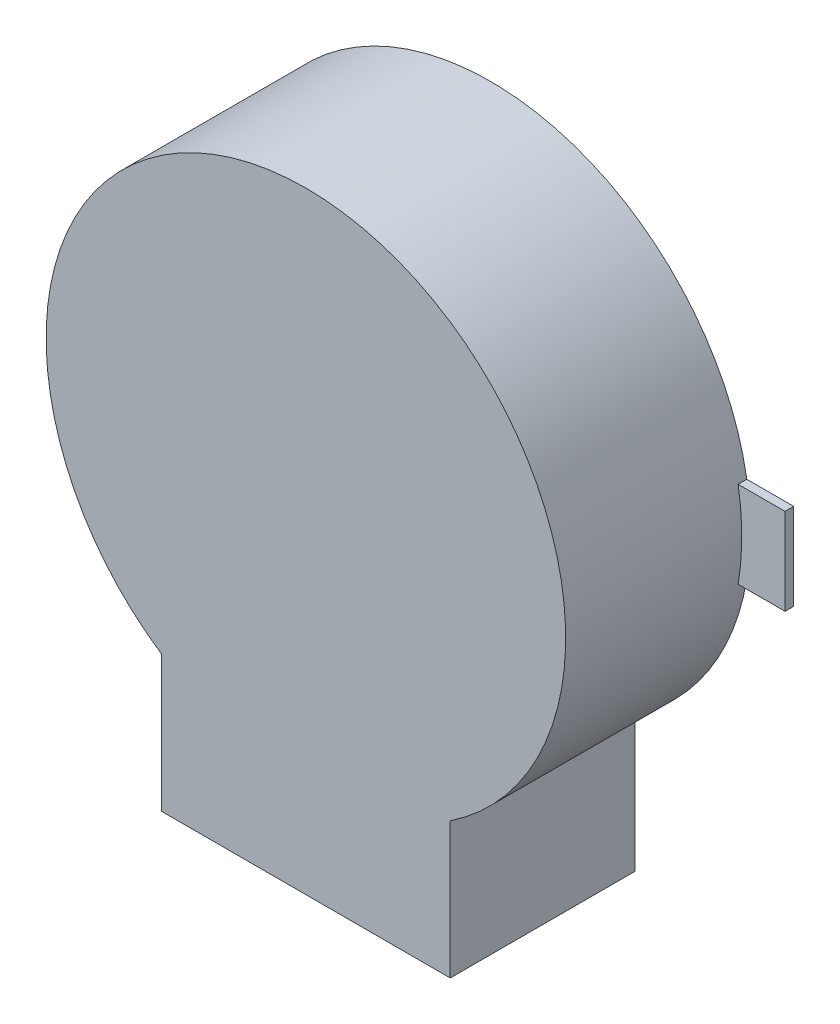
ISO-10303-21;
HEADER;
FILE_DESCRIPTION(('STEP AP214'),'2;1');
FILE_NAME('part.step','',(''),(''),'','','');
FILE_SCHEMA(('AUTOMOTIVE_DESIGN { 1 0 10303 214 1 1 1 1 }'));
ENDSEC;
DATA;
#1=APPLICATION_CONTEXT('core data for automotive mechanical design processes');
#2=APPLICATION_PROTOCOL_DEFINITION('international standard','automotive_design',2000,#1);
#3=PRODUCT_CONTEXT('',#1,'mechanical');
#4=PRODUCT('Part','Part','',(#3));
#5=PRODUCT_RELATED_PRODUCT_CATEGORY('part','',(#4));
#6=PRODUCT_DEFINITION_FORMATION('','',#4);
#7=PRODUCT_DEFINITION_CONTEXT('part definition',#1,'design');
#8=PRODUCT_DEFINITION('design','',#6,#7);
#9=PRODUCT_DEFINITION_SHAPE('','',#8);
#10=(LENGTH_UNIT() NAMED_UNIT(*) SI_UNIT(.MILLI.,.METRE.));
#11=(NAMED_UNIT(*) PLANE_ANGLE_UNIT() SI_UNIT($,.RADIAN.));
#12=(NAMED_UNIT(*) SI_UNIT($,.STERADIAN.) SOLID_ANGLE_UNIT());
#13=UNCERTAINTY_MEASURE_WITH_UNIT(LENGTH_MEASURE(1.E-05),#10,'distance_accuracy_value','');
#14=(GEOMETRIC_REPRESENTATION_CONTEXT(3) GLOBAL_UNCERTAINTY_ASSIGNED_CONTEXT((#13)) GLOBAL_UNIT_ASSIGNED_CONTEXT((#10,
#11,#12)) REPRESENTATION_CONTEXT('',''));
#15=CARTESIAN_POINT('',(0.,0.,0.));
#16=DIRECTION('',(0.,0.,1.));
#17=DIRECTION('',(1.,0.,0.));
#18=AXIS2_PLACEMENT_3D('',#15,#16,#17);
#19=CARTESIAN_POINT('',(-5.25,0.,0.15));
#20=DIRECTION('',(-1.,0.,0.));
#21=DIRECTION('',(0.,0.,1.));
#22=AXIS2_PLACEMENT_3D('',#19,#20,#21);
#23=PLANE('',#22);
#24=DIRECTION('',(0.,1.,0.));
#25=VECTOR('',#24,1.);
#26=CARTESIAN_POINT('',(-5.25,0.,0.));
#27=LINE('',#26,#25);
#28=CARTESIAN_POINT('',(-5.25,-0.75,0.));
#29=VERTEX_POINT('',#28);
#30=CARTESIAN_POINT('',(-5.25,0.75,0.));
#31=VERTEX_POINT('',#30);
#32=EDGE_CURVE('E11',#29,#31,#27,.T.);
#33=ORIENTED_EDGE('',*,*,#32,.F.);
#34=DIRECTION('',(0.,0.,-1.));
#35=VECTOR('',#34,1.);
#36=CARTESIAN_POINT('',(-5.25,-0.75,0.15));
#37=LINE('',#36,#35);
#38=CARTESIAN_POINT('',(-5.25,-0.75,0.15));
#39=VERTEX_POINT('',#38);
#40=EDGE_CURVE('E201',#39,#29,#37,.T.);
#41=ORIENTED_EDGE('',*,*,#40,.F.);
#42=DIRECTION('',(0.,1.,0.));
#43=VECTOR('',#42,1.);
#44=CARTESIAN_POINT('',(-5.25,0.,0.15));
#45=LINE('',#44,#43);
#46=CARTESIAN_POINT('',(-5.25,0.75,0.15));
#47=VERTEX_POINT('',#46);
#48=EDGE_CURVE('E190',#39,#47,#45,.T.);
#49=ORIENTED_EDGE('',*,*,#48,.T.);
#50=DIRECTION('',(0.,0.,-1.));
#51=VECTOR('',#50,1.);
#52=CARTESIAN_POINT('',(-5.25,0.75,0.15));
#53=LINE('',#52,#51);
#54=EDGE_CURVE('E174',#47,#31,#53,.T.);
#55=ORIENTED_EDGE('',*,*,#54,.T.);
#56=EDGE_LOOP('',(#33,#41,#49,#55));
#57=FACE_BOUND('',#56,.T.);
#58=ADVANCED_FACE('F17',(#57),#23,.T.);
#59=CARTESIAN_POINT('',(0.,-0.8,3.2));
#60=DIRECTION('',(0.,0.,1.));
#61=DIRECTION('',(1.,0.,0.));
#62=AXIS2_PLACEMENT_3D('',#59,#60,#61);
#63=PLANE('',#62);
#64=CARTESIAN_POINT('',(0.,0.,3.2));
#65=DIRECTION('',(0.,0.,1.));
#66=DIRECTION('',(1.,0.,0.));
#67=AXIS2_PLACEMENT_3D('',#64,#65,#66);
#68=CIRCLE('',#67,4.5);
#69=CARTESIAN_POINT('',(2.5,-3.74165738677395,3.2));
#70=VERTEX_POINT('',#69);
#71=CARTESIAN_POINT('',(-2.5,-3.74165738677394,3.2));
#72=VERTEX_POINT('',#71);
#73=EDGE_CURVE('E212',#70,#72,#68,.T.);
#74=ORIENTED_EDGE('',*,*,#73,.T.);
#75=DIRECTION('',(0.,-1.,0.));
#76=VECTOR('',#75,1.);
#77=CARTESIAN_POINT('',(-2.5,-4.92082869338697,3.2));
#78=LINE('',#77,#76);
#79=CARTESIAN_POINT('',(-2.5,-6.1,3.2));
#80=VERTEX_POINT('',#79);
#81=EDGE_CURVE('E184',#72,#80,#78,.T.);
#82=ORIENTED_EDGE('',*,*,#81,.T.);
#83=DIRECTION('',(1.,0.,0.));
#84=VECTOR('',#83,1.);
#85=CARTESIAN_POINT('',(0.,-6.1,3.2));
#86=LINE('',#85,#84);
#87=CARTESIAN_POINT('',(2.5,-6.1,3.2));
#88=VERTEX_POINT('',#87);
#89=EDGE_CURVE('E202',#80,#88,#86,.T.);
#90=ORIENTED_EDGE('',*,*,#89,.T.);
#91=DIRECTION('',(0.,-1.,0.));
#92=VECTOR('',#91,1.);
#93=CARTESIAN_POINT('',(2.5,-4.92082869338697,3.2));
#94=LINE('',#93,#92);
#95=EDGE_CURVE('E28',#70,#88,#94,.T.);
#96=ORIENTED_EDGE('',*,*,#95,.F.);
#97=EDGE_LOOP('',(#74,#82,#90,#96));
#98=FACE_BOUND('',#97,.T.);
#99=ADVANCED_FACE('F305',(#98),#63,.T.);
#100=CARTESIAN_POINT('',(0.,-0.8,0.));
#101=DIRECTION('',(0.,0.,1.));
#102=DIRECTION('',(1.,0.,0.));
#103=AXIS2_PLACEMENT_3D('',#100,#101,#102);
#104=PLANE('',#103);
#105=CARTESIAN_POINT('',(0.,0.,0.));
#106=DIRECTION('',(0.,0.,1.));
#107=DIRECTION('',(1.,0.,0.));
#108=AXIS2_PLACEMENT_3D('',#105,#106,#107);
#109=CIRCLE('',#108,4.5);
#110=CARTESIAN_POINT('',(-4.43705983732471,-0.75,0.));
#111=VERTEX_POINT('',#110);
#112=CARTESIAN_POINT('',(-2.5,-3.74165738677394,0.));
#113=VERTEX_POINT('',#112);
#114=EDGE_CURVE('E175',#111,#113,#109,.T.);
#115=ORIENTED_EDGE('',*,*,#114,.F.);
#116=DIRECTION('',(1.,0.,0.));
#117=VECTOR('',#116,1.);
#118=CARTESIAN_POINT('',(0.,-0.75,0.));
#119=LINE('',#118,#117);
#120=EDGE_CURVE('E198',#29,#111,#119,.T.);
#121=ORIENTED_EDGE('',*,*,#120,.F.);
#122=ORIENTED_EDGE('',*,*,#32,.T.);
#123=DIRECTION('',(1.,0.,0.));
#124=VECTOR('',#123,1.);
#125=CARTESIAN_POINT('',(0.,0.75,0.));
#126=LINE('',#125,#124);
#127=CARTESIAN_POINT('',(-4.43705983732471,0.75,0.));
#128=VERTEX_POINT('',#127);
#129=EDGE_CURVE('E21',#31,#128,#126,.T.);
#130=ORIENTED_EDGE('',*,*,#129,.T.);
#131=CARTESIAN_POINT('',(0.,0.,0.));
#132=DIRECTION('',(0.,0.,1.));
#133=DIRECTION('',(1.,0.,0.));
#134=AXIS2_PLACEMENT_3D('',#131,#132,#133);
#135=CIRCLE('',#134,4.5);
#136=CARTESIAN_POINT('',(4.43705983732471,0.75,0.));
#137=VERTEX_POINT('',#136);
#138=EDGE_CURVE('E144',#137,#128,#135,.T.);
#139=ORIENTED_EDGE('',*,*,#138,.F.);
#140=DIRECTION('',(1.,0.,0.));
#141=VECTOR('',#140,1.);
#142=CARTESIAN_POINT('',(0.,0.75,0.));
#143=LINE('',#142,#141);
#144=CARTESIAN_POINT('',(5.25,0.75,0.));
#145=VERTEX_POINT('',#144);
#146=EDGE_CURVE('E139',#137,#145,#143,.T.);
#147=ORIENTED_EDGE('',*,*,#146,.T.);
#148=DIRECTION('',(0.,1.,0.));
#149=VECTOR('',#148,1.);
#150=CARTESIAN_POINT('',(5.25,0.,0.));
#151=LINE('',#150,#149);
#152=CARTESIAN_POINT('',(5.25,-0.75,0.));
#153=VERTEX_POINT('',#152);
#154=EDGE_CURVE('E131',#153,#145,#151,.T.);
#155=ORIENTED_EDGE('',*,*,#154,.F.);
#156=DIRECTION('',(1.,0.,0.));
#157=VECTOR('',#156,1.);
#158=CARTESIAN_POINT('',(0.,-0.75,0.));
#159=LINE('',#158,#157);
#160=CARTESIAN_POINT('',(4.43705983732471,-0.75,0.));
#161=VERTEX_POINT('',#160);
#162=EDGE_CURVE('E136',#161,#153,#159,.T.);
#163=ORIENTED_EDGE('',*,*,#162,.F.);
#164=CARTESIAN_POINT('',(0.,0.,0.));
#165=DIRECTION('',(0.,0.,1.));
#166=DIRECTION('',(1.,0.,0.));
#167=AXIS2_PLACEMENT_3D('',#164,#165,#166);
#168=CIRCLE('',#167,4.5);
#169=CARTESIAN_POINT('',(2.5,-3.74165738677395,0.));
#170=VERTEX_POINT('',#169);
#171=EDGE_CURVE('E272',#170,#161,#168,.T.);
#172=ORIENTED_EDGE('',*,*,#171,.F.);
#173=DIRECTION('',(0.,-1.,0.));
#174=VECTOR('',#173,1.);
#175=CARTESIAN_POINT('',(2.5,-4.92082869338697,0.));
#176=LINE('',#175,#174);
#177=CARTESIAN_POINT('',(2.5,-6.1,0.));
#178=VERTEX_POINT('',#177);
#179=EDGE_CURVE('E205',#170,#178,#176,.T.);
#180=ORIENTED_EDGE('',*,*,#179,.T.);
#181=DIRECTION('',(1.,0.,0.));
#182=VECTOR('',#181,1.);
#183=CARTESIAN_POINT('',(0.,-6.1,0.));
#184=LINE('',#183,#182);
#185=CARTESIAN_POINT('',(-2.5,-6.1,0.));
#186=VERTEX_POINT('',#185);
#187=EDGE_CURVE('E281',#186,#178,#184,.T.);
#188=ORIENTED_EDGE('',*,*,#187,.F.);
#189=DIRECTION('',(0.,-1.,0.));
#190=VECTOR('',#189,1.);
#191=CARTESIAN_POINT('',(-2.5,-4.92082869338697,0.));
#192=LINE('',#191,#190);
#193=EDGE_CURVE('E185',#113,#186,#192,.T.);
#194=ORIENTED_EDGE('',*,*,#193,.F.);
#195=EDGE_LOOP('',(#115,#121,#122,#130,#139,#147,#155,#163,#172,#180,#188,#194));
#196=FACE_BOUND('',#195,.T.);
#197=ADVANCED_FACE('F133',(#196),#104,.F.);
#198=CARTESIAN_POINT('',(2.5,-4.92082869338697,3.2));
#199=DIRECTION('',(1.,0.,0.));
#200=DIRECTION('',(0.,1.,0.));
#201=AXIS2_PLACEMENT_3D('',#198,#199,#200);
#202=PLANE('',#201);
#203=ORIENTED_EDGE('',*,*,#179,.F.);
#204=DIRECTION('',(0.,0.,-1.));
#205=VECTOR('',#204,1.);
#206=CARTESIAN_POINT('',(2.5,-3.74165738677395,3.2));
#207=LINE('',#206,#205);
#208=EDGE_CURVE('E216',#70,#170,#207,.T.);
#209=ORIENTED_EDGE('',*,*,#208,.F.);
#210=ORIENTED_EDGE('',*,*,#95,.T.);
#211=DIRECTION('',(0.,0.,-1.));
#212=VECTOR('',#211,1.);
#213=CARTESIAN_POINT('',(2.5,-6.1,3.2));
#214=LINE('',#213,#212);
#215=EDGE_CURVE('E206',#88,#178,#214,.T.);
#216=ORIENTED_EDGE('',*,*,#215,.T.);
#217=EDGE_LOOP('',(#203,#209,#210,#216));
#218=FACE_BOUND('',#217,.T.);
#219=ADVANCED_FACE('F291',(#218),#202,.T.);
#220=CARTESIAN_POINT('',(0.,-6.1,3.2));
#221=DIRECTION('',(0.,1.,0.));
#222=DIRECTION('',(1.,0.,0.));
#223=AXIS2_PLACEMENT_3D('',#220,#221,#222);
#224=PLANE('',#223);
#225=ORIENTED_EDGE('',*,*,#187,.T.);
#226=ORIENTED_EDGE('',*,*,#215,.F.);
#227=ORIENTED_EDGE('',*,*,#89,.F.);
#228=DIRECTION('',(0.,0.,-1.));
#229=VECTOR('',#228,1.);
#230=CARTESIAN_POINT('',(-2.5,-6.1,3.2));
#231=LINE('',#230,#229);
#232=EDGE_CURVE('E180',#80,#186,#231,.T.);
#233=ORIENTED_EDGE('',*,*,#232,.T.);
#234=EDGE_LOOP('',(#225,#226,#227,#233));
#235=FACE_BOUND('',#234,.T.);
#236=ADVANCED_FACE('F293',(#235),#224,.F.);
#237=CARTESIAN_POINT('',(-2.5,-4.92082869338697,3.2));
#238=DIRECTION('',(1.,0.,0.));
#239=DIRECTION('',(0.,1.,0.));
#240=AXIS2_PLACEMENT_3D('',#237,#238,#239);
#241=PLANE('',#240);
#242=ORIENTED_EDGE('',*,*,#193,.T.);
#243=ORIENTED_EDGE('',*,*,#232,.F.);
#244=ORIENTED_EDGE('',*,*,#81,.F.);
#245=DIRECTION('',(0.,0.,-1.));
#246=VECTOR('',#245,1.);
#247=CARTESIAN_POINT('',(-2.5,-3.74165738677394,3.2));
#248=LINE('',#247,#246);
#249=EDGE_CURVE('E179',#72,#113,#248,.T.);
#250=ORIENTED_EDGE('',*,*,#249,.T.);
#251=EDGE_LOOP('',(#242,#243,#244,#250));
#252=FACE_BOUND('',#251,.T.);
#253=ADVANCED_FACE('F301',(#252),#241,.F.);
#254=CARTESIAN_POINT('',(0.,0.,3.2));
#255=DIRECTION('',(0.,0.,1.));
#256=DIRECTION('',(-1.,0.,0.));
#257=AXIS2_PLACEMENT_3D('',#254,#255,#256);
#258=CYLINDRICAL_SURFACE('',#257,4.5);
#259=DIRECTION('',(0.,0.,-1.));
#260=VECTOR('',#259,1.);
#261=CARTESIAN_POINT('',(4.43705983732471,-0.75,3.2));
#262=LINE('',#261,#260);
#263=CARTESIAN_POINT('',(4.43705983732471,-0.75,0.15));
#264=VERTEX_POINT('',#263);
#265=EDGE_CURVE('E159',#264,#161,#262,.T.);
#266=ORIENTED_EDGE('',*,*,#265,.F.);
#267=CARTESIAN_POINT('',(0.,0.,0.15));
#268=DIRECTION('',(0.,0.,-1.));
#269=DIRECTION('',(-1.,0.,0.));
#270=AXIS2_PLACEMENT_3D('',#267,#268,#269);
#271=CIRCLE('',#270,4.5);
#272=CARTESIAN_POINT('',(4.43705983732471,0.75,0.15));
#273=VERTEX_POINT('',#272);
#274=EDGE_CURVE('E228',#273,#264,#271,.T.);
#275=ORIENTED_EDGE('',*,*,#274,.F.);
#276=DIRECTION('',(0.,0.,-1.));
#277=VECTOR('',#276,1.);
#278=CARTESIAN_POINT('',(4.43705983732471,0.75,3.2));
#279=LINE('',#278,#277);
#280=EDGE_CURVE('E170',#273,#137,#279,.T.);
#281=ORIENTED_EDGE('',*,*,#280,.T.);
#282=ORIENTED_EDGE('',*,*,#138,.T.);
#283=DIRECTION('',(0.,0.,1.));
#284=VECTOR('',#283,1.);
#285=CARTESIAN_POINT('',(-4.43705983732471,0.75,3.2));
#286=LINE('',#285,#284);
#287=CARTESIAN_POINT('',(-4.43705983732471,0.75,0.15));
#288=VERTEX_POINT('',#287);
#289=EDGE_CURVE('E249',#128,#288,#286,.T.);
#290=ORIENTED_EDGE('',*,*,#289,.T.);
#291=CARTESIAN_POINT('',(0.,0.,0.15));
#292=DIRECTION('',(0.,0.,-1.));
#293=DIRECTION('',(-1.,0.,0.));
#294=AXIS2_PLACEMENT_3D('',#291,#292,#293);
#295=CIRCLE('',#294,4.5);
#296=CARTESIAN_POINT('',(-4.43705983732471,-0.75,0.15));
#297=VERTEX_POINT('',#296);
#298=EDGE_CURVE('E155',#297,#288,#295,.T.);
#299=ORIENTED_EDGE('',*,*,#298,.F.);
#300=DIRECTION('',(0.,0.,1.));
#301=VECTOR('',#300,1.);
#302=CARTESIAN_POINT('',(-4.43705983732471,-0.75,3.2));
#303=LINE('',#302,#301);
#304=EDGE_CURVE('E193',#111,#297,#303,.T.);
#305=ORIENTED_EDGE('',*,*,#304,.F.);
#306=ORIENTED_EDGE('',*,*,#114,.T.);
#307=ORIENTED_EDGE('',*,*,#249,.F.);
#308=ORIENTED_EDGE('',*,*,#73,.F.);
#309=ORIENTED_EDGE('',*,*,#208,.T.);
#310=ORIENTED_EDGE('',*,*,#171,.T.);
#311=EDGE_LOOP('',(#266,#275,#281,#282,#290,#299,#305,#306,#307,#308,#309,#310));
#312=FACE_BOUND('',#311,.T.);
#313=ADVANCED_FACE('F246',(#312),#258,.T.);
#314=CARTESIAN_POINT('',(5.25,0.,0.15));
#315=DIRECTION('',(-1.,0.,0.));
#316=DIRECTION('',(0.,0.,1.));
#317=AXIS2_PLACEMENT_3D('',#314,#315,#316);
#318=PLANE('',#317);
#319=ORIENTED_EDGE('',*,*,#154,.T.);
#320=DIRECTION('',(0.,0.,-1.));
#321=VECTOR('',#320,1.);
#322=CARTESIAN_POINT('',(5.25,0.75,0.15));
#323=LINE('',#322,#321);
#324=CARTESIAN_POINT('',(5.25,0.75,0.15));
#325=VERTEX_POINT('',#324);
#326=EDGE_CURVE('E173',#325,#145,#323,.T.);
#327=ORIENTED_EDGE('',*,*,#326,.F.);
#328=DIRECTION('',(0.,1.,0.));
#329=VECTOR('',#328,1.);
#330=CARTESIAN_POINT('',(5.25,0.,0.15));
#331=LINE('',#330,#329);
#332=CARTESIAN_POINT('',(5.25,-0.75,0.15));
#333=VERTEX_POINT('',#332);
#334=EDGE_CURVE('E150',#333,#325,#331,.T.);
#335=ORIENTED_EDGE('',*,*,#334,.F.);
#336=DIRECTION('',(0.,0.,-1.));
#337=VECTOR('',#336,1.);
#338=CARTESIAN_POINT('',(5.25,-0.75,0.15));
#339=LINE('',#338,#337);
#340=EDGE_CURVE('E147',#333,#153,#339,.T.);
#341=ORIENTED_EDGE('',*,*,#340,.T.);
#342=EDGE_LOOP('',(#319,#327,#335,#341));
#343=FACE_BOUND('',#342,.T.);
#344=ADVANCED_FACE('F148',(#343),#318,.F.);
#345=CARTESIAN_POINT('',(0.,0.75,0.15));
#346=DIRECTION('',(0.,1.,0.));
#347=DIRECTION('',(1.,0.,0.));
#348=AXIS2_PLACEMENT_3D('',#345,#346,#347);
#349=PLANE('',#348);
#350=ORIENTED_EDGE('',*,*,#280,.F.);
#351=DIRECTION('',(1.,0.,0.));
#352=VECTOR('',#351,1.);
#353=CARTESIAN_POINT('',(0.,0.75,0.15));
#354=LINE('',#353,#352);
#355=EDGE_CURVE('E220',#273,#325,#354,.T.);
#356=ORIENTED_EDGE('',*,*,#355,.T.);
#357=ORIENTED_EDGE('',*,*,#326,.T.);
#358=ORIENTED_EDGE('',*,*,#146,.F.);
#359=EDGE_LOOP('',(#350,#356,#357,#358));
#360=FACE_BOUND('',#359,.T.);
#361=ADVANCED_FACE('F325',(#360),#349,.T.);
#362=CARTESIAN_POINT('',(0.,0.75,0.15));
#363=DIRECTION('',(0.,1.,0.));
#364=DIRECTION('',(1.,0.,0.));
#365=AXIS2_PLACEMENT_3D('',#362,#363,#364);
#366=PLANE('',#365);
#367=ORIENTED_EDGE('',*,*,#289,.F.);
#368=ORIENTED_EDGE('',*,*,#129,.F.);
#369=ORIENTED_EDGE('',*,*,#54,.F.);
#370=DIRECTION('',(1.,0.,0.));
#371=VECTOR('',#370,1.);
#372=CARTESIAN_POINT('',(0.,0.75,0.15));
#373=LINE('',#372,#371);
#374=EDGE_CURVE('E186',#47,#288,#373,.T.);
#375=ORIENTED_EDGE('',*,*,#374,.T.);
#376=EDGE_LOOP('',(#367,#368,#369,#375));
#377=FACE_BOUND('',#376,.T.);
#378=ADVANCED_FACE('F255',(#377),#366,.T.);
#379=CARTESIAN_POINT('',(0.,-0.8,0.15));
#380=DIRECTION('',(0.,0.,-1.));
#381=DIRECTION('',(0.,-1.,0.));
#382=AXIS2_PLACEMENT_3D('',#379,#380,#381);
#383=PLANE('',#382);
#384=ORIENTED_EDGE('',*,*,#355,.F.);
#385=ORIENTED_EDGE('',*,*,#274,.T.);
#386=DIRECTION('',(1.,0.,0.));
#387=VECTOR('',#386,1.);
#388=CARTESIAN_POINT('',(0.,-0.75,0.15));
#389=LINE('',#388,#387);
#390=EDGE_CURVE('E166',#264,#333,#389,.T.);
#391=ORIENTED_EDGE('',*,*,#390,.T.);
#392=ORIENTED_EDGE('',*,*,#334,.T.);
#393=EDGE_LOOP('',(#384,#385,#391,#392));
#394=FACE_BOUND('',#393,.T.);
#395=ADVANCED_FACE('F319',(#394),#383,.F.);
#396=CARTESIAN_POINT('',(0.,-0.8,0.15));
#397=DIRECTION('',(0.,0.,-1.));
#398=DIRECTION('',(0.,-1.,0.));
#399=AXIS2_PLACEMENT_3D('',#396,#397,#398);
#400=PLANE('',#399);
#401=DIRECTION('',(1.,0.,0.));
#402=VECTOR('',#401,1.);
#403=CARTESIAN_POINT('',(0.,-0.75,0.15));
#404=LINE('',#403,#402);
#405=EDGE_CURVE('E197',#39,#297,#404,.T.);
#406=ORIENTED_EDGE('',*,*,#405,.T.);
#407=ORIENTED_EDGE('',*,*,#298,.T.);
#408=ORIENTED_EDGE('',*,*,#374,.F.);
#409=ORIENTED_EDGE('',*,*,#48,.F.);
#410=EDGE_LOOP('',(#406,#407,#408,#409));
#411=FACE_BOUND('',#410,.T.);
#412=ADVANCED_FACE('F19',(#411),#400,.F.);
#413=CARTESIAN_POINT('',(0.,-0.75,0.15));
#414=DIRECTION('',(0.,1.,0.));
#415=DIRECTION('',(1.,0.,0.));
#416=AXIS2_PLACEMENT_3D('',#413,#414,#415);
#417=PLANE('',#416);
#418=ORIENTED_EDGE('',*,*,#390,.F.);
#419=ORIENTED_EDGE('',*,*,#265,.T.);
#420=ORIENTED_EDGE('',*,*,#162,.T.);
#421=ORIENTED_EDGE('',*,*,#340,.F.);
#422=EDGE_LOOP('',(#418,#419,#420,#421));
#423=FACE_BOUND('',#422,.T.);
#424=ADVANCED_FACE('F157',(#423),#417,.F.);
#425=CARTESIAN_POINT('',(0.,-0.75,0.15));
#426=DIRECTION('',(0.,1.,0.));
#427=DIRECTION('',(1.,0.,0.));
#428=AXIS2_PLACEMENT_3D('',#425,#426,#427);
#429=PLANE('',#428);
#430=ORIENTED_EDGE('',*,*,#120,.T.);
#431=ORIENTED_EDGE('',*,*,#304,.T.);
#432=ORIENTED_EDGE('',*,*,#405,.F.);
#433=ORIENTED_EDGE('',*,*,#40,.T.);
#434=EDGE_LOOP('',(#430,#431,#432,#433));
#435=FACE_BOUND('',#434,.T.);
#436=ADVANCED_FACE('F259',(#435),#429,.F.);
#437=CLOSED_SHELL('',(#58,#99,#197,#219,#236,#253,#313,#344,#361,#378,#395,#412,#424,#436));
#438=MANIFOLD_SOLID_BREP('B1',#437);
#439=ADVANCED_BREP_SHAPE_REPRESENTATION('',(#18,#438),#14);
#440=SHAPE_DEFINITION_REPRESENTATION(#9,#439);
ENDSEC;
END-ISO-10303-21;
